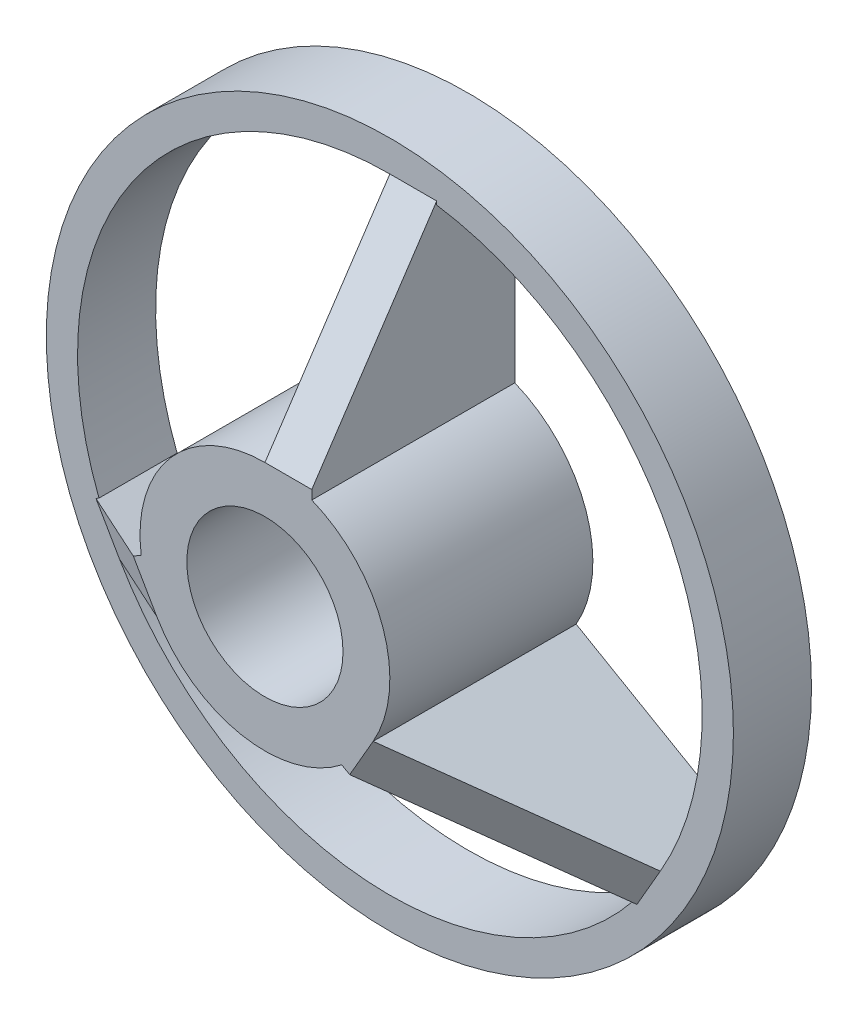
ISO-10303-21;
HEADER;
FILE_DESCRIPTION(('STEP AP214'),'2;1');
FILE_NAME('part.step','',(''),(''),'','','');
FILE_SCHEMA(('AUTOMOTIVE_DESIGN { 1 0 10303 214 1 1 1 1 }'));
ENDSEC;
DATA;
#1=APPLICATION_CONTEXT('core data for automotive mechanical design processes');
#2=APPLICATION_PROTOCOL_DEFINITION('international standard','automotive_design',2000,#1);
#3=PRODUCT_CONTEXT('',#1,'mechanical');
#4=PRODUCT('Part','Part','',(#3));
#5=PRODUCT_RELATED_PRODUCT_CATEGORY('part','',(#4));
#6=PRODUCT_DEFINITION_FORMATION('','',#4);
#7=PRODUCT_DEFINITION_CONTEXT('part definition',#1,'design');
#8=PRODUCT_DEFINITION('design','',#6,#7);
#9=PRODUCT_DEFINITION_SHAPE('','',#8);
#10=(LENGTH_UNIT() NAMED_UNIT(*) SI_UNIT(.MILLI.,.METRE.));
#11=(NAMED_UNIT(*) PLANE_ANGLE_UNIT() SI_UNIT($,.RADIAN.));
#12=(NAMED_UNIT(*) SI_UNIT($,.STERADIAN.) SOLID_ANGLE_UNIT());
#13=UNCERTAINTY_MEASURE_WITH_UNIT(LENGTH_MEASURE(1.E-05),#10,'distance_accuracy_value','');
#14=(GEOMETRIC_REPRESENTATION_CONTEXT(3) GLOBAL_UNCERTAINTY_ASSIGNED_CONTEXT((#13)) GLOBAL_UNIT_ASSIGNED_CONTEXT((#10,
#11,#12)) REPRESENTATION_CONTEXT('',''));
#15=CARTESIAN_POINT('',(0.,0.,0.));
#16=DIRECTION('',(0.,0.,1.));
#17=DIRECTION('',(1.,0.,0.));
#18=AXIS2_PLACEMENT_3D('',#15,#16,#17);
#19=CARTESIAN_POINT('',(0.,0.,5.));
#20=DIRECTION('',(0.,0.,1.));
#21=DIRECTION('',(1.,0.,0.));
#22=AXIS2_PLACEMENT_3D('',#19,#20,#21);
#23=PLANE('',#22);
#24=CARTESIAN_POINT('',(0.,0.,5.));
#25=DIRECTION('',(0.,0.,1.));
#26=DIRECTION('',(1.,0.,0.));
#27=AXIS2_PLACEMENT_3D('',#24,#25,#26);
#28=CIRCLE('',#27,22.);
#29=CARTESIAN_POINT('',(22.,0.,5.));
#30=VERTEX_POINT('',#29);
#31=EDGE_CURVE('E309',#30,#30,#28,.T.);
#32=ORIENTED_EDGE('',*,*,#31,.T.);
#33=EDGE_LOOP('',(#32));
#34=FACE_BOUND('',#33,.T.);
#35=CARTESIAN_POINT('',(0.,0.,5.));
#36=DIRECTION('',(0.,0.,1.));
#37=DIRECTION('',(1.,0.,0.));
#38=AXIS2_PLACEMENT_3D('',#35,#36,#37);
#39=CIRCLE('',#38,20.);
#40=CARTESIAN_POINT('',(17.3205080756889,-9.99999999999984,5.));
#41=VERTEX_POINT('',#40);
#42=CARTESIAN_POINT('',(3.,19.7737199332852,5.));
#43=VERTEX_POINT('',#42);
#44=EDGE_CURVE('E303',#41,#43,#39,.T.);
#45=ORIENTED_EDGE('',*,*,#44,.F.);
#46=DIRECTION('',(0.499999999999992,0.866025403784443,0.));
#47=VECTOR('',#46,1.);
#48=CARTESIAN_POINT('',(15.8205080756889,-12.5980762113532,5.));
#49=LINE('',#48,#47);
#50=CARTESIAN_POINT('',(15.8205080756889,-12.5980762113532,5.));
#51=VERTEX_POINT('',#50);
#52=EDGE_CURVE('E61',#51,#41,#49,.T.);
#53=ORIENTED_EDGE('',*,*,#52,.F.);
#54=DIRECTION('',(-0.866025403784443,0.499999999999992,0.));
#55=VECTOR('',#54,1.);
#56=CARTESIAN_POINT('',(-1.49999999999998,-2.59807621135333,5.));
#57=LINE('',#56,#55);
#58=CARTESIAN_POINT('',(15.6245437895438,-12.4849361779958,5.));
#59=VERTEX_POINT('',#58);
#60=EDGE_CURVE('E158',#51,#59,#57,.T.);
#61=ORIENTED_EDGE('',*,*,#60,.T.);
#62=CARTESIAN_POINT('',(-17.3205080756887,-10.0000000000001,5.));
#63=VERTEX_POINT('',#62);
#64=EDGE_CURVE('E302',#63,#59,#39,.T.);
#65=ORIENTED_EDGE('',*,*,#64,.F.);
#66=DIRECTION('',(0.500000000000004,-0.866025403784436,0.));
#67=VECTOR('',#66,1.);
#68=CARTESIAN_POINT('',(-18.8205080756887,-7.40192378864677,5.));
#69=LINE('',#68,#67);
#70=CARTESIAN_POINT('',(-18.8205080756887,-7.40192378864677,5.));
#71=VERTEX_POINT('',#70);
#72=EDGE_CURVE('E226',#71,#63,#69,.T.);
#73=ORIENTED_EDGE('',*,*,#72,.F.);
#74=DIRECTION('',(0.866025403784436,0.500000000000004,0.));
#75=VECTOR('',#74,1.);
#76=CARTESIAN_POINT('',(-1.50000000000001,2.59807621135331,5.));
#77=LINE('',#76,#75);
#78=CARTESIAN_POINT('',(-18.6245437895437,-7.28878375528936,5.));
#79=VERTEX_POINT('',#78);
#80=EDGE_CURVE('E237',#71,#79,#77,.T.);
#81=ORIENTED_EDGE('',*,*,#80,.T.);
#82=CARTESIAN_POINT('',(0.,20.,5.));
#83=VERTEX_POINT('',#82);
#84=EDGE_CURVE('E297',#83,#79,#39,.T.);
#85=ORIENTED_EDGE('',*,*,#84,.F.);
#86=DIRECTION('',(-1.,0.,0.));
#87=VECTOR('',#86,1.);
#88=CARTESIAN_POINT('',(3.,20.,5.));
#89=LINE('',#88,#87);
#90=CARTESIAN_POINT('',(3.,20.,5.));
#91=VERTEX_POINT('',#90);
#92=EDGE_CURVE('E288',#91,#83,#89,.T.);
#93=ORIENTED_EDGE('',*,*,#92,.F.);
#94=DIRECTION('',(0.,-1.,0.));
#95=VECTOR('',#94,1.);
#96=CARTESIAN_POINT('',(3.,0.,5.));
#97=LINE('',#96,#95);
#98=EDGE_CURVE('E292',#91,#43,#97,.T.);
#99=ORIENTED_EDGE('',*,*,#98,.T.);
#100=EDGE_LOOP('',(#45,#53,#61,#65,#73,#81,#85,#93,#99));
#101=FACE_BOUND('',#100,.T.);
#102=ADVANCED_FACE('F45',(#34,#101),#23,.T.);
#103=CARTESIAN_POINT('',(0.,0.,5.));
#104=DIRECTION('',(0.,0.,-1.));
#105=DIRECTION('',(-1.,0.,0.));
#106=AXIS2_PLACEMENT_3D('',#103,#104,#105);
#107=CYLINDRICAL_SURFACE('',#106,20.);
#108=ORIENTED_EDGE('',*,*,#64,.T.);
#109=DIRECTION('',(0.,0.,-1.));
#110=VECTOR('',#109,1.);
#111=CARTESIAN_POINT('',(15.6245437895438,-12.4849361779958,5.));
#112=LINE('',#111,#110);
#113=CARTESIAN_POINT('',(15.6245437895438,-12.4849361779958,0.));
#114=VERTEX_POINT('',#113);
#115=EDGE_CURVE('E197',#59,#114,#112,.T.);
#116=ORIENTED_EDGE('',*,*,#115,.T.);
#117=CARTESIAN_POINT('',(0.,0.,0.));
#118=DIRECTION('',(0.,0.,1.));
#119=DIRECTION('',(1.,0.,0.));
#120=AXIS2_PLACEMENT_3D('',#117,#118,#119);
#121=CIRCLE('',#120,20.);
#122=CARTESIAN_POINT('',(-17.3205080756887,-10.0000000000001,0.));
#123=VERTEX_POINT('',#122);
#124=EDGE_CURVE('E308',#123,#114,#121,.T.);
#125=ORIENTED_EDGE('',*,*,#124,.F.);
#126=DIRECTION('',(0.,0.,1.));
#127=VECTOR('',#126,1.);
#128=CARTESIAN_POINT('',(-17.3205080756887,-10.0000000000001,5.));
#129=LINE('',#128,#127);
#130=EDGE_CURVE('E218',#123,#63,#129,.T.);
#131=ORIENTED_EDGE('',*,*,#130,.T.);
#132=EDGE_LOOP('',(#108,#116,#125,#131));
#133=FACE_BOUND('',#132,.T.);
#134=ADVANCED_FACE('F381',(#133),#107,.F.);
#135=CARTESIAN_POINT('',(0.,0.,13.));
#136=DIRECTION('',(0.,0.,-1.));
#137=DIRECTION('',(-1.,0.,0.));
#138=AXIS2_PLACEMENT_3D('',#135,#136,#137);
#139=CYLINDRICAL_SURFACE('',#138,8.);
#140=DIRECTION('',(0.,0.,-1.));
#141=VECTOR('',#140,1.);
#142=CARTESIAN_POINT('',(4.92261628933262,-6.3061754549011,13.));
#143=LINE('',#142,#141);
#144=CARTESIAN_POINT('',(4.92261628933262,-6.3061754549011,13.));
#145=VERTEX_POINT('',#144);
#146=CARTESIAN_POINT('',(4.92261628933262,-6.3061754549011,0.));
#147=VERTEX_POINT('',#146);
#148=EDGE_CURVE('E11',#145,#147,#143,.T.);
#149=ORIENTED_EDGE('',*,*,#148,.F.);
#150=CARTESIAN_POINT('',(0.,0.,13.));
#151=DIRECTION('',(0.,0.,1.));
#152=DIRECTION('',(1.,0.,0.));
#153=AXIS2_PLACEMENT_3D('',#150,#151,#152);
#154=CIRCLE('',#153,8.);
#155=CARTESIAN_POINT('',(-6.92820323027549,-4.00000000000003,13.));
#156=VERTEX_POINT('',#155);
#157=EDGE_CURVE('E178',#156,#145,#154,.T.);
#158=ORIENTED_EDGE('',*,*,#157,.F.);
#159=DIRECTION('',(0.,0.,-1.));
#160=VECTOR('',#159,1.);
#161=CARTESIAN_POINT('',(-6.92820323027549,-4.00000000000003,13.));
#162=LINE('',#161,#160);
#163=CARTESIAN_POINT('',(-6.92820323027549,-4.00000000000003,0.));
#164=VERTEX_POINT('',#163);
#165=EDGE_CURVE('E230',#156,#164,#162,.T.);
#166=ORIENTED_EDGE('',*,*,#165,.T.);
#167=CARTESIAN_POINT('',(0.,0.,0.));
#168=DIRECTION('',(0.,0.,1.));
#169=DIRECTION('',(1.,0.,0.));
#170=AXIS2_PLACEMENT_3D('',#167,#168,#169);
#171=CIRCLE('',#170,8.);
#172=EDGE_CURVE('E259',#164,#147,#171,.T.);
#173=ORIENTED_EDGE('',*,*,#172,.T.);
#174=EDGE_LOOP('',(#149,#158,#166,#173));
#175=FACE_BOUND('',#174,.T.);
#176=ADVANCED_FACE('F363',(#175),#139,.T.);
#177=ORIENTED_EDGE('',*,*,#84,.T.);
#178=DIRECTION('',(0.,0.,-1.));
#179=VECTOR('',#178,1.);
#180=CARTESIAN_POINT('',(-18.6245437895437,-7.28878375528936,5.));
#181=LINE('',#180,#179);
#182=CARTESIAN_POINT('',(-18.6245437895437,-7.28878375528936,0.));
#183=VERTEX_POINT('',#182);
#184=EDGE_CURVE('E234',#79,#183,#181,.T.);
#185=ORIENTED_EDGE('',*,*,#184,.T.);
#186=CARTESIAN_POINT('',(0.,20.,0.));
#187=VERTEX_POINT('',#186);
#188=EDGE_CURVE('E304',#187,#183,#121,.T.);
#189=ORIENTED_EDGE('',*,*,#188,.F.);
#190=DIRECTION('',(0.,0.,1.));
#191=VECTOR('',#190,1.);
#192=CARTESIAN_POINT('',(0.,20.,5.));
#193=LINE('',#192,#191);
#194=EDGE_CURVE('E279',#187,#83,#193,.T.);
#195=ORIENTED_EDGE('',*,*,#194,.T.);
#196=EDGE_LOOP('',(#177,#185,#189,#195));
#197=FACE_BOUND('',#196,.T.);
#198=ADVANCED_FACE('F356',(#197),#107,.F.);
#199=DIRECTION('',(0.,0.,-1.));
#200=VECTOR('',#199,1.);
#201=CARTESIAN_POINT('',(-7.92261628933256,-1.11002303219455,13.));
#202=LINE('',#201,#200);
#203=CARTESIAN_POINT('',(-7.92261628933256,-1.11002303219455,13.));
#204=VERTEX_POINT('',#203);
#205=CARTESIAN_POINT('',(-7.92261628933256,-1.11002303219455,0.));
#206=VERTEX_POINT('',#205);
#207=EDGE_CURVE('E54',#204,#206,#202,.T.);
#208=ORIENTED_EDGE('',*,*,#207,.F.);
#209=CARTESIAN_POINT('',(0.,8.,13.));
#210=VERTEX_POINT('',#209);
#211=EDGE_CURVE('E249',#210,#204,#154,.T.);
#212=ORIENTED_EDGE('',*,*,#211,.F.);
#213=DIRECTION('',(0.,0.,-1.));
#214=VECTOR('',#213,1.);
#215=CARTESIAN_POINT('',(0.,8.,13.));
#216=LINE('',#215,#214);
#217=CARTESIAN_POINT('',(0.,8.,0.));
#218=VERTEX_POINT('',#217);
#219=EDGE_CURVE('E320',#218,#210,#216,.F.);
#220=ORIENTED_EDGE('',*,*,#219,.F.);
#221=EDGE_CURVE('E255',#218,#206,#171,.T.);
#222=ORIENTED_EDGE('',*,*,#221,.T.);
#223=EDGE_LOOP('',(#208,#212,#220,#222));
#224=FACE_BOUND('',#223,.T.);
#225=ADVANCED_FACE('F338',(#224),#139,.T.);
#226=CARTESIAN_POINT('',(3.,0.,0.));
#227=DIRECTION('',(-1.,0.,0.));
#228=DIRECTION('',(0.,0.,1.));
#229=AXIS2_PLACEMENT_3D('',#226,#227,#228);
#230=PLANE('',#229);
#231=DIRECTION('',(0.,0.,-1.));
#232=VECTOR('',#231,1.);
#233=CARTESIAN_POINT('',(3.,7.41619848709566,13.));
#234=LINE('',#233,#232);
#235=CARTESIAN_POINT('',(3.,7.41619848709566,0.));
#236=VERTEX_POINT('',#235);
#237=CARTESIAN_POINT('',(3.,7.41619848709566,13.));
#238=VERTEX_POINT('',#237);
#239=EDGE_CURVE('E253',#236,#238,#234,.F.);
#240=ORIENTED_EDGE('',*,*,#239,.F.);
#241=DIRECTION('',(0.,1.,0.));
#242=VECTOR('',#241,1.);
#243=CARTESIAN_POINT('',(3.,5.,0.));
#244=LINE('',#243,#242);
#245=CARTESIAN_POINT('',(3.,19.7737199332852,0.));
#246=VERTEX_POINT('',#245);
#247=EDGE_CURVE('E264',#236,#246,#244,.T.);
#248=ORIENTED_EDGE('',*,*,#247,.T.);
#249=DIRECTION('',(0.,0.,-1.));
#250=VECTOR('',#249,1.);
#251=CARTESIAN_POINT('',(3.,19.7737199332852,5.));
#252=LINE('',#251,#250);
#253=EDGE_CURVE('E313',#43,#246,#252,.T.);
#254=ORIENTED_EDGE('',*,*,#253,.F.);
#255=ORIENTED_EDGE('',*,*,#98,.F.);
#256=DIRECTION('',(0.,-0.832050294337844,0.554700196225229));
#257=VECTOR('',#256,1.);
#258=CARTESIAN_POINT('',(3.,8.,13.));
#259=LINE('',#258,#257);
#260=CARTESIAN_POINT('',(3.,8.,13.));
#261=VERTEX_POINT('',#260);
#262=EDGE_CURVE('E268',#91,#261,#259,.T.);
#263=ORIENTED_EDGE('',*,*,#262,.T.);
#264=DIRECTION('',(0.,-1.,0.));
#265=VECTOR('',#264,1.);
#266=CARTESIAN_POINT('',(3.,8.,13.));
#267=LINE('',#266,#265);
#268=EDGE_CURVE('E272',#261,#238,#267,.T.);
#269=ORIENTED_EDGE('',*,*,#268,.T.);
#270=EDGE_LOOP('',(#240,#248,#254,#255,#263,#269));
#271=FACE_BOUND('',#270,.T.);
#272=ADVANCED_FACE('F350',(#271),#230,.F.);
#273=CARTESIAN_POINT('',(0.,0.,0.));
#274=DIRECTION('',(-1.,0.,0.));
#275=DIRECTION('',(0.,0.,1.));
#276=AXIS2_PLACEMENT_3D('',#273,#274,#275);
#277=PLANE('',#276);
#278=DIRECTION('',(0.,1.,0.));
#279=VECTOR('',#278,1.);
#280=CARTESIAN_POINT('',(0.,20.,0.));
#281=LINE('',#280,#279);
#282=EDGE_CURVE('E263',#218,#187,#281,.T.);
#283=ORIENTED_EDGE('',*,*,#282,.F.);
#284=ORIENTED_EDGE('',*,*,#219,.T.);
#285=DIRECTION('',(0.,-0.832050294337844,0.554700196225229));
#286=VECTOR('',#285,1.);
#287=CARTESIAN_POINT('',(0.,8.,13.));
#288=LINE('',#287,#286);
#289=EDGE_CURVE('E269',#83,#210,#288,.T.);
#290=ORIENTED_EDGE('',*,*,#289,.F.);
#291=ORIENTED_EDGE('',*,*,#194,.F.);
#292=EDGE_LOOP('',(#283,#284,#290,#291));
#293=FACE_BOUND('',#292,.T.);
#294=ADVANCED_FACE('F341',(#293),#277,.T.);
#295=DIRECTION('',(0.,0.,1.));
#296=VECTOR('',#295,1.);
#297=CARTESIAN_POINT('',(17.3205080756889,-9.99999999999984,5.));
#298=LINE('',#297,#296);
#299=CARTESIAN_POINT('',(17.3205080756889,-9.99999999999984,0.));
#300=VERTEX_POINT('',#299);
#301=EDGE_CURVE('E69',#300,#41,#298,.T.);
#302=ORIENTED_EDGE('',*,*,#301,.T.);
#303=ORIENTED_EDGE('',*,*,#44,.T.);
#304=ORIENTED_EDGE('',*,*,#253,.T.);
#305=EDGE_CURVE('E296',#300,#246,#121,.T.);
#306=ORIENTED_EDGE('',*,*,#305,.F.);
#307=EDGE_LOOP('',(#302,#303,#304,#306));
#308=FACE_BOUND('',#307,.T.);
#309=ADVANCED_FACE('F375',(#308),#107,.F.);
#310=CARTESIAN_POINT('',(0.,0.,0.));
#311=DIRECTION('',(0.,0.,1.));
#312=DIRECTION('',(1.,0.,0.));
#313=AXIS2_PLACEMENT_3D('',#310,#311,#312);
#314=PLANE('',#313);
#315=DIRECTION('',(0.866025403784443,-0.499999999999992,0.));
#316=VECTOR('',#315,1.);
#317=CARTESIAN_POINT('',(17.3205080756889,-9.99999999999984,0.));
#318=LINE('',#317,#316);
#319=CARTESIAN_POINT('',(6.92820323027555,-3.99999999999994,0.));
#320=VERTEX_POINT('',#319);
#321=EDGE_CURVE('E183',#320,#300,#318,.T.);
#322=ORIENTED_EDGE('',*,*,#321,.T.);
#323=ORIENTED_EDGE('',*,*,#305,.T.);
#324=ORIENTED_EDGE('',*,*,#247,.F.);
#325=EDGE_CURVE('E245',#320,#236,#171,.T.);
#326=ORIENTED_EDGE('',*,*,#325,.F.);
#327=EDGE_LOOP('',(#322,#323,#324,#326));
#328=FACE_BOUND('',#327,.T.);
#329=CARTESIAN_POINT('',(0.,0.,0.));
#330=DIRECTION('',(0.,0.,1.));
#331=DIRECTION('',(1.,0.,0.));
#332=AXIS2_PLACEMENT_3D('',#329,#330,#331);
#333=CIRCLE('',#332,5.);
#334=CARTESIAN_POINT('',(5.,0.,0.));
#335=VERTEX_POINT('',#334);
#336=EDGE_CURVE('E240',#335,#335,#333,.T.);
#337=ORIENTED_EDGE('',*,*,#336,.T.);
#338=EDGE_LOOP('',(#337));
#339=FACE_BOUND('',#338,.T.);
#340=DIRECTION('',(0.866025403784443,-0.499999999999992,0.));
#341=VECTOR('',#340,1.);
#342=CARTESIAN_POINT('',(2.83012701892224,-5.09807621135329,0.));
#343=LINE('',#342,#341);
#344=EDGE_CURVE('E161',#147,#114,#343,.T.);
#345=ORIENTED_EDGE('',*,*,#344,.F.);
#346=ORIENTED_EDGE('',*,*,#172,.F.);
#347=DIRECTION('',(-0.866025403784436,-0.500000000000004,0.));
#348=VECTOR('',#347,1.);
#349=CARTESIAN_POINT('',(-17.3205080756887,-10.0000000000001,0.));
#350=LINE('',#349,#348);
#351=EDGE_CURVE('E202',#164,#123,#350,.T.);
#352=ORIENTED_EDGE('',*,*,#351,.T.);
#353=ORIENTED_EDGE('',*,*,#124,.T.);
#354=EDGE_LOOP('',(#345,#346,#352,#353));
#355=FACE_BOUND('',#354,.T.);
#356=DIRECTION('',(-0.866025403784436,-0.500000000000004,0.));
#357=VECTOR('',#356,1.);
#358=CARTESIAN_POINT('',(-5.83012701892219,0.0980762113532885,0.));
#359=LINE('',#358,#357);
#360=EDGE_CURVE('E203',#206,#183,#359,.T.);
#361=ORIENTED_EDGE('',*,*,#360,.F.);
#362=ORIENTED_EDGE('',*,*,#221,.F.);
#363=ORIENTED_EDGE('',*,*,#282,.T.);
#364=ORIENTED_EDGE('',*,*,#188,.T.);
#365=EDGE_LOOP('',(#361,#362,#363,#364));
#366=FACE_BOUND('',#365,.T.);
#367=CARTESIAN_POINT('',(0.,0.,0.));
#368=DIRECTION('',(0.,0.,1.));
#369=DIRECTION('',(1.,0.,0.));
#370=AXIS2_PLACEMENT_3D('',#367,#368,#369);
#371=CIRCLE('',#370,22.);
#372=CARTESIAN_POINT('',(22.,0.,0.));
#373=VERTEX_POINT('',#372);
#374=EDGE_CURVE('E301',#373,#373,#371,.T.);
#375=ORIENTED_EDGE('',*,*,#374,.F.);
#376=EDGE_LOOP('',(#375));
#377=FACE_BOUND('',#376,.T.);
#378=ADVANCED_FACE('F334',(#328,#339,#355,#366,#377),#314,.F.);
#379=CARTESIAN_POINT('',(0.,0.,5.));
#380=DIRECTION('',(0.,0.,-1.));
#381=DIRECTION('',(-1.,0.,0.));
#382=AXIS2_PLACEMENT_3D('',#379,#380,#381);
#383=CYLINDRICAL_SURFACE('',#382,22.);
#384=ORIENTED_EDGE('',*,*,#31,.F.);
#385=EDGE_LOOP('',(#384));
#386=FACE_BOUND('',#385,.T.);
#387=ORIENTED_EDGE('',*,*,#374,.T.);
#388=EDGE_LOOP('',(#387));
#389=FACE_BOUND('',#388,.T.);
#390=ADVANCED_FACE('F47',(#386,#389),#383,.T.);
#391=CARTESIAN_POINT('',(3.,8.,13.));
#392=DIRECTION('',(0.,-0.554700196225229,-0.832050294337844));
#393=DIRECTION('',(0.,0.832050294337843,-0.554700196225229));
#394=AXIS2_PLACEMENT_3D('',#391,#392,#393);
#395=PLANE('',#394);
#396=ORIENTED_EDGE('',*,*,#289,.T.);
#397=DIRECTION('',(-1.,0.,0.));
#398=VECTOR('',#397,1.);
#399=CARTESIAN_POINT('',(3.,8.,13.));
#400=LINE('',#399,#398);
#401=EDGE_CURVE('E276',#261,#210,#400,.T.);
#402=ORIENTED_EDGE('',*,*,#401,.F.);
#403=ORIENTED_EDGE('',*,*,#262,.F.);
#404=ORIENTED_EDGE('',*,*,#92,.T.);
#405=EDGE_LOOP('',(#396,#402,#403,#404));
#406=FACE_BOUND('',#405,.T.);
#407=ADVANCED_FACE('F345',(#406),#395,.F.);
#408=CARTESIAN_POINT('',(3.,8.,13.));
#409=DIRECTION('',(0.,0.,-1.));
#410=DIRECTION('',(-1.,0.,0.));
#411=AXIS2_PLACEMENT_3D('',#408,#409,#410);
#412=PLANE('',#411);
#413=ORIENTED_EDGE('',*,*,#157,.T.);
#414=DIRECTION('',(-0.866025403784443,0.499999999999992,0.));
#415=VECTOR('',#414,1.);
#416=CARTESIAN_POINT('',(5.42820323027557,-6.59807621135327,13.));
#417=LINE('',#416,#415);
#418=CARTESIAN_POINT('',(5.42820323027557,-6.59807621135327,13.));
#419=VERTEX_POINT('',#418);
#420=EDGE_CURVE('E155',#419,#145,#417,.T.);
#421=ORIENTED_EDGE('',*,*,#420,.F.);
#422=DIRECTION('',(0.499999999999992,0.866025403784443,0.));
#423=VECTOR('',#422,1.);
#424=CARTESIAN_POINT('',(5.42820323027557,-6.59807621135327,13.));
#425=LINE('',#424,#423);
#426=CARTESIAN_POINT('',(6.92820323027555,-3.99999999999994,13.));
#427=VERTEX_POINT('',#426);
#428=EDGE_CURVE('E165',#419,#427,#425,.T.);
#429=ORIENTED_EDGE('',*,*,#428,.T.);
#430=EDGE_CURVE('E254',#427,#238,#154,.T.);
#431=ORIENTED_EDGE('',*,*,#430,.T.);
#432=ORIENTED_EDGE('',*,*,#268,.F.);
#433=ORIENTED_EDGE('',*,*,#401,.T.);
#434=ORIENTED_EDGE('',*,*,#211,.T.);
#435=DIRECTION('',(0.866025403784436,0.500000000000004,0.));
#436=VECTOR('',#435,1.);
#437=CARTESIAN_POINT('',(-8.4282032302755,-1.40192378864672,13.));
#438=LINE('',#437,#436);
#439=CARTESIAN_POINT('',(-8.4282032302755,-1.40192378864672,13.));
#440=VERTEX_POINT('',#439);
#441=EDGE_CURVE('E211',#440,#204,#438,.T.);
#442=ORIENTED_EDGE('',*,*,#441,.F.);
#443=DIRECTION('',(0.500000000000004,-0.866025403784436,0.));
#444=VECTOR('',#443,1.);
#445=CARTESIAN_POINT('',(-8.4282032302755,-1.40192378864672,13.));
#446=LINE('',#445,#444);
#447=EDGE_CURVE('E214',#440,#156,#446,.T.);
#448=ORIENTED_EDGE('',*,*,#447,.T.);
#449=EDGE_LOOP('',(#413,#421,#429,#431,#432,#433,#434,#442,#448));
#450=FACE_BOUND('',#449,.T.);
#451=CARTESIAN_POINT('',(0.,0.,13.));
#452=DIRECTION('',(0.,0.,1.));
#453=DIRECTION('',(1.,0.,0.));
#454=AXIS2_PLACEMENT_3D('',#451,#452,#453);
#455=CIRCLE('',#454,5.);
#456=CARTESIAN_POINT('',(5.,0.,13.));
#457=VERTEX_POINT('',#456);
#458=EDGE_CURVE('E241',#457,#457,#455,.T.);
#459=ORIENTED_EDGE('',*,*,#458,.F.);
#460=EDGE_LOOP('',(#459));
#461=FACE_BOUND('',#460,.T.);
#462=ADVANCED_FACE('F174',(#450,#461),#412,.F.);
#463=ORIENTED_EDGE('',*,*,#430,.F.);
#464=DIRECTION('',(0.,0.,-1.));
#465=VECTOR('',#464,1.);
#466=CARTESIAN_POINT('',(6.92820323027555,-3.99999999999994,13.));
#467=LINE('',#466,#465);
#468=EDGE_CURVE('E193',#427,#320,#467,.T.);
#469=ORIENTED_EDGE('',*,*,#468,.T.);
#470=ORIENTED_EDGE('',*,*,#325,.T.);
#471=ORIENTED_EDGE('',*,*,#239,.T.);
#472=EDGE_LOOP('',(#463,#469,#470,#471));
#473=FACE_BOUND('',#472,.T.);
#474=ADVANCED_FACE('F372',(#473),#139,.T.);
#475=CARTESIAN_POINT('',(0.,0.,13.));
#476=DIRECTION('',(0.,0.,-1.));
#477=DIRECTION('',(-1.,0.,0.));
#478=AXIS2_PLACEMENT_3D('',#475,#476,#477);
#479=CYLINDRICAL_SURFACE('',#478,5.);
#480=ORIENTED_EDGE('',*,*,#336,.F.);
#481=EDGE_LOOP('',(#480));
#482=FACE_BOUND('',#481,.T.);
#483=ORIENTED_EDGE('',*,*,#458,.T.);
#484=EDGE_LOOP('',(#483));
#485=FACE_BOUND('',#484,.T.);
#486=ADVANCED_FACE('F399',(#482,#485),#479,.F.);
#487=CARTESIAN_POINT('',(-1.50000000000001,2.59807621135331,0.));
#488=DIRECTION('',(0.500000000000004,-0.866025403784436,0.));
#489=DIRECTION('',(0.,0.,1.));
#490=AXIS2_PLACEMENT_3D('',#487,#488,#489);
#491=PLANE('',#490);
#492=ORIENTED_EDGE('',*,*,#80,.F.);
#493=DIRECTION('',(0.72057669212289,0.416025147168925,0.554700196225229));
#494=VECTOR('',#493,1.);
#495=CARTESIAN_POINT('',(-8.4282032302755,-1.40192378864672,13.));
#496=LINE('',#495,#494);
#497=EDGE_CURVE('E207',#71,#440,#496,.T.);
#498=ORIENTED_EDGE('',*,*,#497,.T.);
#499=ORIENTED_EDGE('',*,*,#441,.T.);
#500=ORIENTED_EDGE('',*,*,#207,.T.);
#501=ORIENTED_EDGE('',*,*,#360,.T.);
#502=ORIENTED_EDGE('',*,*,#184,.F.);
#503=EDGE_LOOP('',(#492,#498,#499,#500,#501,#502));
#504=FACE_BOUND('',#503,.T.);
#505=ADVANCED_FACE('F328',(#504),#491,.F.);
#506=CARTESIAN_POINT('',(0.,0.,0.));
#507=DIRECTION('',(0.500000000000004,-0.866025403784436,0.));
#508=DIRECTION('',(0.,0.,1.));
#509=AXIS2_PLACEMENT_3D('',#506,#507,#508);
#510=PLANE('',#509);
#511=ORIENTED_EDGE('',*,*,#165,.F.);
#512=DIRECTION('',(0.72057669212289,0.416025147168925,0.554700196225229));
#513=VECTOR('',#512,1.);
#514=CARTESIAN_POINT('',(-6.92820323027549,-4.00000000000003,13.));
#515=LINE('',#514,#513);
#516=EDGE_CURVE('E208',#63,#156,#515,.T.);
#517=ORIENTED_EDGE('',*,*,#516,.F.);
#518=ORIENTED_EDGE('',*,*,#130,.F.);
#519=ORIENTED_EDGE('',*,*,#351,.F.);
#520=EDGE_LOOP('',(#511,#517,#518,#519));
#521=FACE_BOUND('',#520,.T.);
#522=ADVANCED_FACE('F391',(#521),#510,.T.);
#523=CARTESIAN_POINT('',(-8.4282032302755,-1.40192378864672,13.));
#524=DIRECTION('',(0.48038446141526,0.277350098112617,-0.832050294337843));
#525=DIRECTION('',(-0.866025403784439,0.,-0.499999999999999));
#526=AXIS2_PLACEMENT_3D('',#523,#524,#525);
#527=PLANE('',#526);
#528=ORIENTED_EDGE('',*,*,#516,.T.);
#529=ORIENTED_EDGE('',*,*,#447,.F.);
#530=ORIENTED_EDGE('',*,*,#497,.F.);
#531=ORIENTED_EDGE('',*,*,#72,.T.);
#532=EDGE_LOOP('',(#528,#529,#530,#531));
#533=FACE_BOUND('',#532,.T.);
#534=ADVANCED_FACE('F360',(#533),#527,.F.);
#535=CARTESIAN_POINT('',(-1.49999999999998,-2.59807621135333,0.));
#536=DIRECTION('',(0.499999999999992,0.866025403784443,0.));
#537=DIRECTION('',(0.,0.,1.));
#538=AXIS2_PLACEMENT_3D('',#535,#536,#537);
#539=PLANE('',#538);
#540=ORIENTED_EDGE('',*,*,#60,.F.);
#541=DIRECTION('',(-0.720576692122896,0.416025147168915,0.554700196225229));
#542=VECTOR('',#541,1.);
#543=CARTESIAN_POINT('',(5.42820323027557,-6.59807621135327,13.));
#544=LINE('',#543,#542);
#545=EDGE_CURVE('E151',#51,#419,#544,.T.);
#546=ORIENTED_EDGE('',*,*,#545,.T.);
#547=ORIENTED_EDGE('',*,*,#420,.T.);
#548=ORIENTED_EDGE('',*,*,#148,.T.);
#549=ORIENTED_EDGE('',*,*,#344,.T.);
#550=ORIENTED_EDGE('',*,*,#115,.F.);
#551=EDGE_LOOP('',(#540,#546,#547,#548,#549,#550));
#552=FACE_BOUND('',#551,.T.);
#553=ADVANCED_FACE('F153',(#552),#539,.F.);
#554=CARTESIAN_POINT('',(0.,0.,0.));
#555=DIRECTION('',(0.499999999999992,0.866025403784443,0.));
#556=DIRECTION('',(0.,0.,1.));
#557=AXIS2_PLACEMENT_3D('',#554,#555,#556);
#558=PLANE('',#557);
#559=ORIENTED_EDGE('',*,*,#468,.F.);
#560=DIRECTION('',(-0.720576692122896,0.416025147168915,0.554700196225229));
#561=VECTOR('',#560,1.);
#562=CARTESIAN_POINT('',(6.92820323027555,-3.99999999999994,13.));
#563=LINE('',#562,#561);
#564=EDGE_CURVE('E168',#41,#427,#563,.T.);
#565=ORIENTED_EDGE('',*,*,#564,.F.);
#566=ORIENTED_EDGE('',*,*,#301,.F.);
#567=ORIENTED_EDGE('',*,*,#321,.F.);
#568=EDGE_LOOP('',(#559,#565,#566,#567));
#569=FACE_BOUND('',#568,.T.);
#570=ADVANCED_FACE('F539',(#569),#558,.T.);
#571=CARTESIAN_POINT('',(5.42820323027557,-6.59807621135327,13.));
#572=DIRECTION('',(-0.480384461415264,0.27735009811261,-0.832050294337844));
#573=DIRECTION('',(-0.866025403784437,0.,0.500000000000002));
#574=AXIS2_PLACEMENT_3D('',#571,#572,#573);
#575=PLANE('',#574);
#576=ORIENTED_EDGE('',*,*,#564,.T.);
#577=ORIENTED_EDGE('',*,*,#428,.F.);
#578=ORIENTED_EDGE('',*,*,#545,.F.);
#579=ORIENTED_EDGE('',*,*,#52,.T.);
#580=EDGE_LOOP('',(#576,#577,#578,#579));
#581=FACE_BOUND('',#580,.T.);
#582=ADVANCED_FACE('F166',(#581),#575,.F.);
#583=CLOSED_SHELL('',(#102,#134,#176,#198,#225,#272,#294,#309,#378,#390,#407,#462,#474,#486,
#505,#522,#534,#553,#570,#582));
#584=MANIFOLD_SOLID_BREP('B2',#583);
#585=ADVANCED_BREP_SHAPE_REPRESENTATION('',(#18,#584),#14);
#586=SHAPE_DEFINITION_REPRESENTATION(#9,#585);
ENDSEC;
END-ISO-10303-21;
